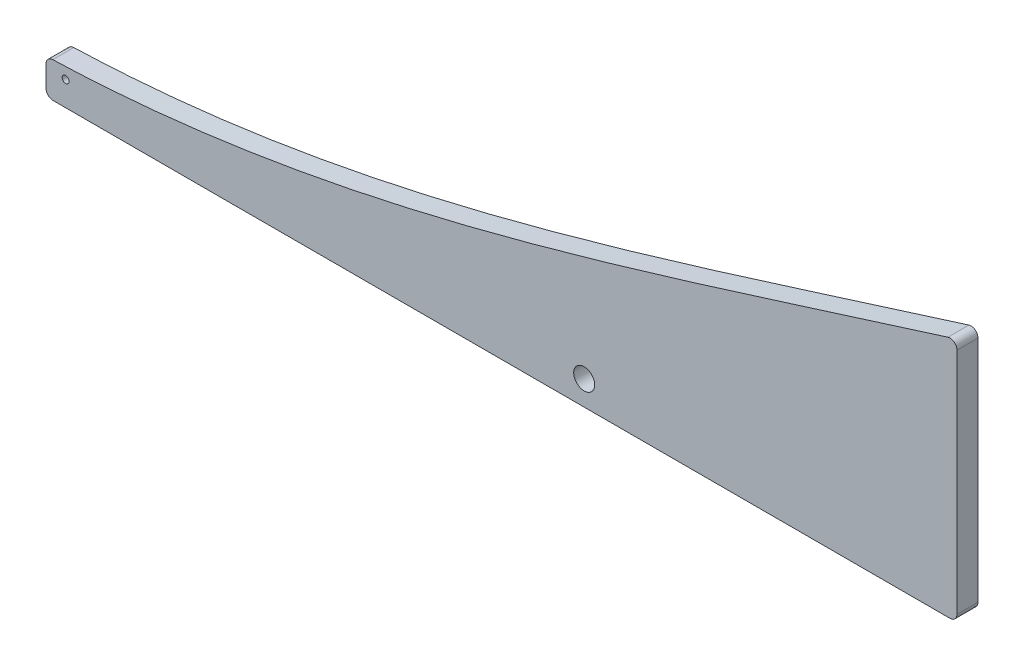
ISO-10303-21;
HEADER;
FILE_DESCRIPTION(('STEP AP214'),'2;1');
FILE_NAME('part.step','',(''),(''),'','','');
FILE_SCHEMA(('AUTOMOTIVE_DESIGN { 1 0 10303 214 1 1 1 1 }'));
ENDSEC;
DATA;
#1=APPLICATION_CONTEXT('core data for automotive mechanical design processes');
#2=APPLICATION_PROTOCOL_DEFINITION('international standard','automotive_design',2000,#1);
#3=PRODUCT_CONTEXT('',#1,'mechanical');
#4=PRODUCT('Part','Part','',(#3));
#5=PRODUCT_RELATED_PRODUCT_CATEGORY('part','',(#4));
#6=PRODUCT_DEFINITION_FORMATION('','',#4);
#7=PRODUCT_DEFINITION_CONTEXT('part definition',#1,'design');
#8=PRODUCT_DEFINITION('design','',#6,#7);
#9=PRODUCT_DEFINITION_SHAPE('','',#8);
#10=(LENGTH_UNIT() NAMED_UNIT(*) SI_UNIT(.MILLI.,.METRE.));
#11=(NAMED_UNIT(*) PLANE_ANGLE_UNIT() SI_UNIT($,.RADIAN.));
#12=(NAMED_UNIT(*) SI_UNIT($,.STERADIAN.) SOLID_ANGLE_UNIT());
#13=UNCERTAINTY_MEASURE_WITH_UNIT(LENGTH_MEASURE(1.E-05),#10,'distance_accuracy_value','');
#14=(GEOMETRIC_REPRESENTATION_CONTEXT(3) GLOBAL_UNCERTAINTY_ASSIGNED_CONTEXT((#13)) GLOBAL_UNIT_ASSIGNED_CONTEXT((#10,
#11,#12)) REPRESENTATION_CONTEXT('',''));
#15=CARTESIAN_POINT('',(0.,0.,0.));
#16=DIRECTION('',(0.,0.,1.));
#17=DIRECTION('',(1.,0.,0.));
#18=AXIS2_PLACEMENT_3D('',#15,#16,#17);
#19=CARTESIAN_POINT('',(31.819018408463,15.5657142627,3.));
#20=DIRECTION('',(0.,0.,-1.));
#21=DIRECTION('',(-1.,0.,0.));
#22=AXIS2_PLACEMENT_3D('',#19,#20,#21);
#23=PLANE('',#22);
#24=DIRECTION('',(0.,-1.,0.));
#25=VECTOR('',#24,1.);
#26=CARTESIAN_POINT('',(-34.1617357001973,0.,3.));
#27=LINE('',#26,#25);
#28=CARTESIAN_POINT('',(-34.1617357001973,4.02926703232328,3.));
#29=VERTEX_POINT('',#28);
#30=CARTESIAN_POINT('',(-34.1617357001973,1.,3.));
#31=VERTEX_POINT('',#30);
#32=EDGE_CURVE('E154',#29,#31,#27,.T.);
#33=ORIENTED_EDGE('',*,*,#32,.T.);
#34=CARTESIAN_POINT('',(-33.1617357001973,1.,3.));
#35=DIRECTION('',(0.,0.,-1.));
#36=DIRECTION('',(-1.,0.,0.));
#37=AXIS2_PLACEMENT_3D('',#34,#35,#36);
#38=CIRCLE('',#37,1.);
#39=CARTESIAN_POINT('',(-33.1617357001973,0.,3.));
#40=VERTEX_POINT('',#39);
#41=EDGE_CURVE('E181',#31,#40,#38,.F.);
#42=ORIENTED_EDGE('',*,*,#41,.T.);
#43=DIRECTION('',(1.,0.,0.));
#44=VECTOR('',#43,1.);
#45=CARTESIAN_POINT('',(-34.1617357001973,0.,3.));
#46=LINE('',#45,#44);
#47=CARTESIAN_POINT('',(94.8382642998027,0.,3.));
#48=VERTEX_POINT('',#47);
#49=EDGE_CURVE('E129',#40,#48,#46,.T.);
#50=ORIENTED_EDGE('',*,*,#49,.T.);
#51=CARTESIAN_POINT('',(94.8382642998027,1.,3.));
#52=DIRECTION('',(0.,0.,-1.));
#53=DIRECTION('',(-1.,0.,0.));
#54=AXIS2_PLACEMENT_3D('',#51,#52,#53);
#55=CIRCLE('',#54,1.);
#56=CARTESIAN_POINT('',(95.8382642998027,1.,3.));
#57=VERTEX_POINT('',#56);
#58=EDGE_CURVE('E173',#48,#57,#55,.F.);
#59=ORIENTED_EDGE('',*,*,#58,.T.);
#60=DIRECTION('',(0.,1.,0.));
#61=VECTOR('',#60,1.);
#62=CARTESIAN_POINT('',(95.8382642998027,35.,3.));
#63=LINE('',#62,#61);
#64=CARTESIAN_POINT('',(95.8382642998027,33.6435391780012,3.));
#65=VERTEX_POINT('',#64);
#66=EDGE_CURVE('E196',#57,#65,#63,.T.);
#67=ORIENTED_EDGE('',*,*,#66,.T.);
#68=CARTESIAN_POINT('',(94.8382642998027,33.6435391780012,3.));
#69=DIRECTION('',(0.,0.,-1.));
#70=DIRECTION('',(-1.,0.,0.));
#71=AXIS2_PLACEMENT_3D('',#68,#69,#70);
#72=CIRCLE('',#71,1.);
#73=CARTESIAN_POINT('',(94.5419999029911,34.5986451444687,3.));
#74=VERTEX_POINT('',#73);
#75=EDGE_CURVE('E64',#65,#74,#72,.F.);
#76=ORIENTED_EDGE('',*,*,#75,.T.);
#77=CARTESIAN_POINT('',(95.8382642998027,35.,3.));
#78=CARTESIAN_POINT('',(53.6025534007184,21.9473202336607,3.));
#79=CARTESIAN_POINT('',(10.6893194886479,6.22791780020597,3.));
#80=CARTESIAN_POINT('',(-34.1617357001973,5.,3.));
#81=B_SPLINE_CURVE_WITH_KNOTS('',3,(#77,#78,#79,#80),.UNSPECIFIED.,.F.,.F.,(4,4),(0.,1.),.UNSPECIFIED.);
#82=CARTESIAN_POINT('',(-33.1937473263459,5.02875452888905,3.));
#83=VERTEX_POINT('',#82);
#84=EDGE_CURVE('E159',#74,#83,#81,.T.);
#85=ORIENTED_EDGE('',*,*,#84,.T.);
#86=CARTESIAN_POINT('',(-33.1617357001973,4.02926703232328,3.));
#87=DIRECTION('',(0.,0.,-1.));
#88=DIRECTION('',(-1.,0.,0.));
#89=AXIS2_PLACEMENT_3D('',#86,#87,#88);
#90=CIRCLE('',#89,1.);
#91=EDGE_CURVE('E178',#83,#29,#90,.F.);
#92=ORIENTED_EDGE('',*,*,#91,.T.);
#93=EDGE_LOOP('',(#33,#42,#50,#59,#67,#76,#85,#92));
#94=FACE_BOUND('',#93,.T.);
#95=CARTESIAN_POINT('',(-31.3617357001973,3.5,3.));
#96=DIRECTION('',(0.,0.,1.));
#97=DIRECTION('',(1.,0.,0.));
#98=AXIS2_PLACEMENT_3D('',#95,#96,#97);
#99=CIRCLE('',#98,0.499999999999999);
#100=CARTESIAN_POINT('',(-30.8617357001973,3.5,3.));
#101=VERTEX_POINT('',#100);
#102=EDGE_CURVE('E146',#101,#101,#99,.T.);
#103=ORIENTED_EDGE('',*,*,#102,.F.);
#104=EDGE_LOOP('',(#103));
#105=FACE_BOUND('',#104,.T.);
#106=CARTESIAN_POINT('',(42.6382642998027,3.5,3.));
#107=DIRECTION('',(0.,0.,1.));
#108=DIRECTION('',(1.,0.,0.));
#109=AXIS2_PLACEMENT_3D('',#106,#107,#108);
#110=CIRCLE('',#109,1.5);
#111=CARTESIAN_POINT('',(44.1382642998027,3.5,3.));
#112=VERTEX_POINT('',#111);
#113=EDGE_CURVE('E257',#112,#112,#110,.T.);
#114=ORIENTED_EDGE('',*,*,#113,.F.);
#115=EDGE_LOOP('',(#114));
#116=FACE_BOUND('',#115,.T.);
#117=ADVANCED_FACE('F41',(#94,#105,#116),#23,.F.);
#118=CARTESIAN_POINT('',(31.819018408463,15.5657142627,0.));
#119=DIRECTION('',(0.,0.,-1.));
#120=DIRECTION('',(-1.,0.,0.));
#121=AXIS2_PLACEMENT_3D('',#118,#119,#120);
#122=PLANE('',#121);
#123=CARTESIAN_POINT('',(-31.3617357001973,3.5,0.));
#124=DIRECTION('',(0.,0.,1.));
#125=DIRECTION('',(1.,0.,0.));
#126=AXIS2_PLACEMENT_3D('',#123,#124,#125);
#127=CIRCLE('',#126,0.499999999999999);
#128=CARTESIAN_POINT('',(-30.8617357001973,3.5,0.));
#129=VERTEX_POINT('',#128);
#130=EDGE_CURVE('E264',#129,#129,#127,.T.);
#131=ORIENTED_EDGE('',*,*,#130,.T.);
#132=EDGE_LOOP('',(#131));
#133=FACE_BOUND('',#132,.T.);
#134=DIRECTION('',(1.,0.,0.));
#135=VECTOR('',#134,1.);
#136=CARTESIAN_POINT('',(-34.1617357001973,0.,0.));
#137=LINE('',#136,#135);
#138=CARTESIAN_POINT('',(-33.1617357001973,0.,0.));
#139=VERTEX_POINT('',#138);
#140=CARTESIAN_POINT('',(94.8382642998027,0.,0.));
#141=VERTEX_POINT('',#140);
#142=EDGE_CURVE('E126',#139,#141,#137,.T.);
#143=ORIENTED_EDGE('',*,*,#142,.F.);
#144=CARTESIAN_POINT('',(-33.1617357001973,1.,0.));
#145=DIRECTION('',(0.,0.,-1.));
#146=DIRECTION('',(-1.,0.,0.));
#147=AXIS2_PLACEMENT_3D('',#144,#145,#146);
#148=CIRCLE('',#147,1.);
#149=CARTESIAN_POINT('',(-34.1617357001973,1.,0.));
#150=VERTEX_POINT('',#149);
#151=EDGE_CURVE('E108',#139,#150,#148,.T.);
#152=ORIENTED_EDGE('',*,*,#151,.T.);
#153=DIRECTION('',(0.,-1.,0.));
#154=VECTOR('',#153,1.);
#155=CARTESIAN_POINT('',(-34.1617357001973,0.,0.));
#156=LINE('',#155,#154);
#157=CARTESIAN_POINT('',(-34.1617357001973,4.02926703232328,0.));
#158=VERTEX_POINT('',#157);
#159=EDGE_CURVE('E139',#158,#150,#156,.T.);
#160=ORIENTED_EDGE('',*,*,#159,.F.);
#161=CARTESIAN_POINT('',(-33.1617357001973,4.02926703232328,0.));
#162=DIRECTION('',(0.,0.,-1.));
#163=DIRECTION('',(-1.,0.,0.));
#164=AXIS2_PLACEMENT_3D('',#161,#162,#163);
#165=CIRCLE('',#164,1.);
#166=CARTESIAN_POINT('',(-33.1937473263459,5.02875452888905,0.));
#167=VERTEX_POINT('',#166);
#168=EDGE_CURVE('E120',#158,#167,#165,.T.);
#169=ORIENTED_EDGE('',*,*,#168,.T.);
#170=CARTESIAN_POINT('',(95.8382642998027,35.,0.));
#171=CARTESIAN_POINT('',(53.6025534007184,21.9473202336607,0.));
#172=CARTESIAN_POINT('',(10.6893194886479,6.22791780020597,0.));
#173=CARTESIAN_POINT('',(-34.1617357001973,5.,0.));
#174=B_SPLINE_CURVE_WITH_KNOTS('',3,(#170,#171,#172,#173),.UNSPECIFIED.,.F.,.F.,(4,4),(0.,1.),.UNSPECIFIED.);
#175=CARTESIAN_POINT('',(94.5419999029911,34.5986451444687,0.));
#176=VERTEX_POINT('',#175);
#177=EDGE_CURVE('E144',#176,#167,#174,.T.);
#178=ORIENTED_EDGE('',*,*,#177,.F.);
#179=CARTESIAN_POINT('',(94.8382642998027,33.6435391780012,0.));
#180=DIRECTION('',(0.,0.,-1.));
#181=DIRECTION('',(-1.,0.,0.));
#182=AXIS2_PLACEMENT_3D('',#179,#180,#181);
#183=CIRCLE('',#182,1.);
#184=CARTESIAN_POINT('',(95.8382642998027,33.6435391780012,0.));
#185=VERTEX_POINT('',#184);
#186=EDGE_CURVE('E163',#176,#185,#183,.T.);
#187=ORIENTED_EDGE('',*,*,#186,.T.);
#188=DIRECTION('',(0.,1.,0.));
#189=VECTOR('',#188,1.);
#190=CARTESIAN_POINT('',(95.8382642998027,35.,0.));
#191=LINE('',#190,#189);
#192=CARTESIAN_POINT('',(95.8382642998027,1.,0.));
#193=VERTEX_POINT('',#192);
#194=EDGE_CURVE('E138',#193,#185,#191,.T.);
#195=ORIENTED_EDGE('',*,*,#194,.F.);
#196=CARTESIAN_POINT('',(94.8382642998027,1.,0.));
#197=DIRECTION('',(0.,0.,-1.));
#198=DIRECTION('',(-1.,0.,0.));
#199=AXIS2_PLACEMENT_3D('',#196,#197,#198);
#200=CIRCLE('',#199,1.);
#201=EDGE_CURVE('E131',#193,#141,#200,.T.);
#202=ORIENTED_EDGE('',*,*,#201,.T.);
#203=EDGE_LOOP('',(#143,#152,#160,#169,#178,#187,#195,#202));
#204=FACE_BOUND('',#203,.T.);
#205=CARTESIAN_POINT('',(42.6382642998027,3.5,0.));
#206=DIRECTION('',(0.,0.,1.));
#207=DIRECTION('',(1.,0.,0.));
#208=AXIS2_PLACEMENT_3D('',#205,#206,#207);
#209=CIRCLE('',#208,1.5);
#210=CARTESIAN_POINT('',(44.1382642998027,3.5,0.));
#211=VERTEX_POINT('',#210);
#212=EDGE_CURVE('E260',#211,#211,#209,.T.);
#213=ORIENTED_EDGE('',*,*,#212,.T.);
#214=EDGE_LOOP('',(#213));
#215=FACE_BOUND('',#214,.T.);
#216=ADVANCED_FACE('F134',(#133,#204,#215),#122,.T.);
#217=CARTESIAN_POINT('',(-34.1617357001973,0.,3.));
#218=DIRECTION('',(1.,0.,0.));
#219=DIRECTION('',(0.,0.,-1.));
#220=AXIS2_PLACEMENT_3D('',#217,#218,#219);
#221=PLANE('',#220);
#222=ORIENTED_EDGE('',*,*,#159,.T.);
#223=DIRECTION('',(0.,0.,-1.));
#224=VECTOR('',#223,1.);
#225=CARTESIAN_POINT('',(-34.1617357001973,1.,3.));
#226=LINE('',#225,#224);
#227=EDGE_CURVE('E113',#150,#31,#226,.F.);
#228=ORIENTED_EDGE('',*,*,#227,.T.);
#229=ORIENTED_EDGE('',*,*,#32,.F.);
#230=DIRECTION('',(0.,0.,-1.));
#231=VECTOR('',#230,1.);
#232=CARTESIAN_POINT('',(-34.1617357001973,4.02926703232328,3.));
#233=LINE('',#232,#231);
#234=EDGE_CURVE('E119',#29,#158,#233,.T.);
#235=ORIENTED_EDGE('',*,*,#234,.T.);
#236=EDGE_LOOP('',(#222,#228,#229,#235));
#237=FACE_BOUND('',#236,.T.);
#238=ADVANCED_FACE('F225',(#237),#221,.F.);
#239=CARTESIAN_POINT('',(-34.1617357001973,0.,3.));
#240=DIRECTION('',(0.,1.,0.));
#241=DIRECTION('',(0.,0.,1.));
#242=AXIS2_PLACEMENT_3D('',#239,#240,#241);
#243=PLANE('',#242);
#244=ORIENTED_EDGE('',*,*,#49,.F.);
#245=DIRECTION('',(0.,0.,-1.));
#246=VECTOR('',#245,1.);
#247=CARTESIAN_POINT('',(-33.1617357001973,0.,3.));
#248=LINE('',#247,#246);
#249=EDGE_CURVE('E112',#40,#139,#248,.T.);
#250=ORIENTED_EDGE('',*,*,#249,.T.);
#251=ORIENTED_EDGE('',*,*,#142,.T.);
#252=DIRECTION('',(0.,0.,-1.));
#253=VECTOR('',#252,1.);
#254=CARTESIAN_POINT('',(94.8382642998027,0.,3.));
#255=LINE('',#254,#253);
#256=EDGE_CURVE('E132',#141,#48,#255,.F.);
#257=ORIENTED_EDGE('',*,*,#256,.T.);
#258=EDGE_LOOP('',(#244,#250,#251,#257));
#259=FACE_BOUND('',#258,.T.);
#260=ADVANCED_FACE('F125',(#259),#243,.F.);
#261=CARTESIAN_POINT('',(95.8382642998027,35.,3.));
#262=DIRECTION('',(-1.,0.,0.));
#263=DIRECTION('',(0.,0.,1.));
#264=AXIS2_PLACEMENT_3D('',#261,#262,#263);
#265=PLANE('',#264);
#266=ORIENTED_EDGE('',*,*,#194,.T.);
#267=DIRECTION('',(0.,0.,-1.));
#268=VECTOR('',#267,1.);
#269=CARTESIAN_POINT('',(95.8382642998027,33.6435391780012,3.));
#270=LINE('',#269,#268);
#271=EDGE_CURVE('E11',#185,#65,#270,.F.);
#272=ORIENTED_EDGE('',*,*,#271,.T.);
#273=ORIENTED_EDGE('',*,*,#66,.F.);
#274=DIRECTION('',(0.,0.,-1.));
#275=VECTOR('',#274,1.);
#276=CARTESIAN_POINT('',(95.8382642998027,1.,3.));
#277=LINE('',#276,#275);
#278=EDGE_CURVE('E50',#57,#193,#277,.T.);
#279=ORIENTED_EDGE('',*,*,#278,.T.);
#280=EDGE_LOOP('',(#266,#272,#273,#279));
#281=FACE_BOUND('',#280,.T.);
#282=ADVANCED_FACE('F194',(#281),#265,.F.);
#283=DIRECTION('',(0.,0.,-1.));
#284=VECTOR('',#283,1.);
#285=SURFACE_OF_LINEAR_EXTRUSION('',#81,#284);
#286=ORIENTED_EDGE('',*,*,#177,.T.);
#287=DIRECTION('',(0.,0.,-1.));
#288=VECTOR('',#287,1.);
#289=CARTESIAN_POINT('',(-33.1937473263459,5.02875452888905,0.));
#290=LINE('',#289,#288);
#291=EDGE_CURVE('E57',#167,#83,#290,.F.);
#292=ORIENTED_EDGE('',*,*,#291,.T.);
#293=ORIENTED_EDGE('',*,*,#84,.F.);
#294=DIRECTION('',(0.,0.,-1.));
#295=VECTOR('',#294,1.);
#296=CARTESIAN_POINT('',(94.5419999029911,34.5986451444687,3.));
#297=LINE('',#296,#295);
#298=EDGE_CURVE('E184',#74,#176,#297,.T.);
#299=ORIENTED_EDGE('',*,*,#298,.T.);
#300=EDGE_LOOP('',(#286,#292,#293,#299));
#301=FACE_BOUND('',#300,.T.);
#302=ADVANCED_FACE('F203',(#301),#285,.F.);
#303=CARTESIAN_POINT('',(-31.3617357001973,3.5,3.));
#304=DIRECTION('',(0.,0.,-1.));
#305=DIRECTION('',(-1.,0.,0.));
#306=AXIS2_PLACEMENT_3D('',#303,#304,#305);
#307=CYLINDRICAL_SURFACE('',#306,0.499999999999999);
#308=ORIENTED_EDGE('',*,*,#102,.T.);
#309=EDGE_LOOP('',(#308));
#310=FACE_BOUND('',#309,.T.);
#311=ORIENTED_EDGE('',*,*,#130,.F.);
#312=EDGE_LOOP('',(#311));
#313=FACE_BOUND('',#312,.T.);
#314=ADVANCED_FACE('F219',(#310,#313),#307,.F.);
#315=CARTESIAN_POINT('',(42.6382642998027,3.5,3.));
#316=DIRECTION('',(0.,0.,-1.));
#317=DIRECTION('',(-1.,0.,0.));
#318=AXIS2_PLACEMENT_3D('',#315,#316,#317);
#319=CYLINDRICAL_SURFACE('',#318,1.5);
#320=ORIENTED_EDGE('',*,*,#113,.T.);
#321=EDGE_LOOP('',(#320));
#322=FACE_BOUND('',#321,.T.);
#323=ORIENTED_EDGE('',*,*,#212,.F.);
#324=EDGE_LOOP('',(#323));
#325=FACE_BOUND('',#324,.T.);
#326=ADVANCED_FACE('F232',(#322,#325),#319,.F.);
#327=CARTESIAN_POINT('',(-33.1617357001973,1.,3.));
#328=DIRECTION('',(0.,0.,-1.));
#329=DIRECTION('',(-1.,0.,0.));
#330=AXIS2_PLACEMENT_3D('',#327,#328,#329);
#331=CYLINDRICAL_SURFACE('',#330,1.);
#332=ORIENTED_EDGE('',*,*,#41,.F.);
#333=ORIENTED_EDGE('',*,*,#227,.F.);
#334=ORIENTED_EDGE('',*,*,#151,.F.);
#335=ORIENTED_EDGE('',*,*,#249,.F.);
#336=EDGE_LOOP('',(#332,#333,#334,#335));
#337=FACE_BOUND('',#336,.T.);
#338=ADVANCED_FACE('F111',(#337),#331,.T.);
#339=CARTESIAN_POINT('',(-33.1617357001973,4.02926703232328,1.5));
#340=DIRECTION('',(0.,0.,-1.));
#341=DIRECTION('',(-1.,0.,0.));
#342=AXIS2_PLACEMENT_3D('',#339,#340,#341);
#343=CYLINDRICAL_SURFACE('',#342,1.);
#344=ORIENTED_EDGE('',*,*,#91,.F.);
#345=ORIENTED_EDGE('',*,*,#291,.F.);
#346=ORIENTED_EDGE('',*,*,#168,.F.);
#347=ORIENTED_EDGE('',*,*,#234,.F.);
#348=EDGE_LOOP('',(#344,#345,#346,#347));
#349=FACE_BOUND('',#348,.T.);
#350=ADVANCED_FACE('F231',(#349),#343,.T.);
#351=CARTESIAN_POINT('',(94.8382642998027,33.6435391780012,1.5));
#352=DIRECTION('',(0.,0.,-1.));
#353=DIRECTION('',(-1.,0.,0.));
#354=AXIS2_PLACEMENT_3D('',#351,#352,#353);
#355=CYLINDRICAL_SURFACE('',#354,1.);
#356=ORIENTED_EDGE('',*,*,#75,.F.);
#357=ORIENTED_EDGE('',*,*,#271,.F.);
#358=ORIENTED_EDGE('',*,*,#186,.F.);
#359=ORIENTED_EDGE('',*,*,#298,.F.);
#360=EDGE_LOOP('',(#356,#357,#358,#359));
#361=FACE_BOUND('',#360,.T.);
#362=ADVANCED_FACE('F202',(#361),#355,.T.);
#363=CARTESIAN_POINT('',(94.8382642998027,1.,3.));
#364=DIRECTION('',(0.,0.,-1.));
#365=DIRECTION('',(-1.,0.,0.));
#366=AXIS2_PLACEMENT_3D('',#363,#364,#365);
#367=CYLINDRICAL_SURFACE('',#366,1.);
#368=ORIENTED_EDGE('',*,*,#58,.F.);
#369=ORIENTED_EDGE('',*,*,#256,.F.);
#370=ORIENTED_EDGE('',*,*,#201,.F.);
#371=ORIENTED_EDGE('',*,*,#278,.F.);
#372=EDGE_LOOP('',(#368,#369,#370,#371));
#373=FACE_BOUND('',#372,.T.);
#374=ADVANCED_FACE('F43',(#373),#367,.T.);
#375=CLOSED_SHELL('',(#117,#216,#238,#260,#282,#302,#314,#326,#338,#350,#362,#374));
#376=MANIFOLD_SOLID_BREP('B2',#375);
#377=ADVANCED_BREP_SHAPE_REPRESENTATION('',(#18,#376),#14);
#378=SHAPE_DEFINITION_REPRESENTATION(#9,#377);
ENDSEC;
END-ISO-10303-21;
